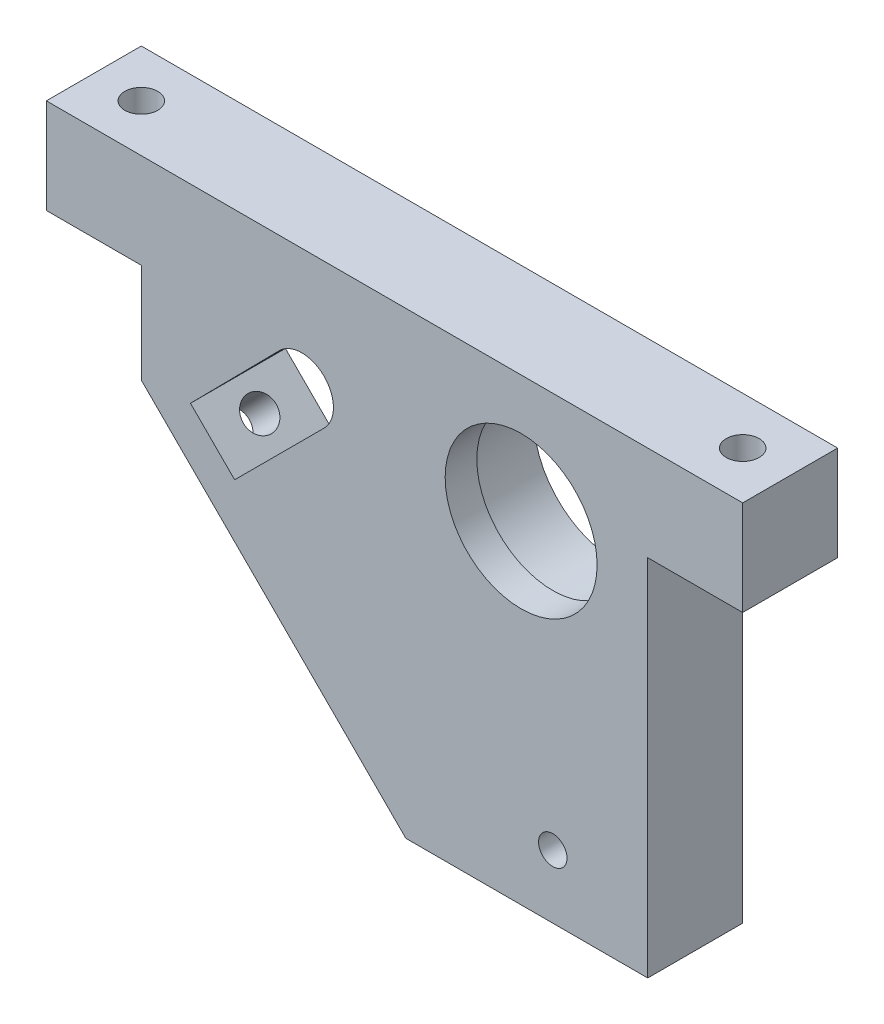
ISO-10303-21;
HEADER;
FILE_DESCRIPTION(('STEP AP214'),'2;1');
FILE_NAME('part.step','',(''),(''),'','','');
FILE_SCHEMA(('AUTOMOTIVE_DESIGN { 1 0 10303 214 1 1 1 1 }'));
ENDSEC;
DATA;
#1=APPLICATION_CONTEXT('core data for automotive mechanical design processes');
#2=APPLICATION_PROTOCOL_DEFINITION('international standard','automotive_design',2000,#1);
#3=PRODUCT_CONTEXT('',#1,'mechanical');
#4=PRODUCT('Part','Part','',(#3));
#5=PRODUCT_RELATED_PRODUCT_CATEGORY('part','',(#4));
#6=PRODUCT_DEFINITION_FORMATION('','',#4);
#7=PRODUCT_DEFINITION_CONTEXT('part definition',#1,'design');
#8=PRODUCT_DEFINITION('design','',#6,#7);
#9=PRODUCT_DEFINITION_SHAPE('','',#8);
#10=(LENGTH_UNIT() NAMED_UNIT(*) SI_UNIT(.MILLI.,.METRE.));
#11=(NAMED_UNIT(*) PLANE_ANGLE_UNIT() SI_UNIT($,.RADIAN.));
#12=(NAMED_UNIT(*) SI_UNIT($,.STERADIAN.) SOLID_ANGLE_UNIT());
#13=UNCERTAINTY_MEASURE_WITH_UNIT(LENGTH_MEASURE(1.E-05),#10,'distance_accuracy_value','');
#14=(GEOMETRIC_REPRESENTATION_CONTEXT(3) GLOBAL_UNCERTAINTY_ASSIGNED_CONTEXT((#13)) GLOBAL_UNIT_ASSIGNED_CONTEXT((#10,
#11,#12)) REPRESENTATION_CONTEXT('',''));
#15=CARTESIAN_POINT('',(0.,0.,0.));
#16=DIRECTION('',(0.,0.,1.));
#17=DIRECTION('',(1.,0.,0.));
#18=AXIS2_PLACEMENT_3D('',#15,#16,#17);
#19=CARTESIAN_POINT('',(41.1990103270224,21.4291974666358,15.));
#20=DIRECTION('',(0.,0.,-1.));
#21=DIRECTION('',(-1.,0.,0.));
#22=AXIS2_PLACEMENT_3D('',#19,#20,#21);
#23=CYLINDRICAL_SURFACE('',#22,12.);
#24=CARTESIAN_POINT('',(41.1990103270224,21.4291974666358,15.));
#25=DIRECTION('',(0.,0.,1.));
#26=DIRECTION('',(1.,0.,0.));
#27=AXIS2_PLACEMENT_3D('',#24,#25,#26);
#28=CIRCLE('',#27,12.);
#29=CARTESIAN_POINT('',(53.1990103270224,21.4291974666358,15.));
#30=VERTEX_POINT('',#29);
#31=EDGE_CURVE('E147',#30,#30,#28,.T.);
#32=ORIENTED_EDGE('',*,*,#31,.T.);
#33=EDGE_LOOP('',(#32));
#34=FACE_BOUND('',#33,.T.);
#35=CARTESIAN_POINT('',(41.1990103270224,21.4291974666358,10.));
#36=DIRECTION('',(0.,0.,-1.));
#37=DIRECTION('',(-1.,0.,0.));
#38=AXIS2_PLACEMENT_3D('',#35,#36,#37);
#39=CIRCLE('',#38,12.);
#40=CARTESIAN_POINT('',(29.1990103270224,21.4291974666358,10.));
#41=VERTEX_POINT('',#40);
#42=EDGE_CURVE('E234',#41,#41,#39,.T.);
#43=ORIENTED_EDGE('',*,*,#42,.T.);
#44=EDGE_LOOP('',(#43));
#45=FACE_BOUND('',#44,.T.);
#46=ADVANCED_FACE('F34',(#34,#45),#23,.F.);
#47=CARTESIAN_POINT('',(0.,0.,15.));
#48=DIRECTION('',(0.,0.,1.));
#49=DIRECTION('',(1.,0.,0.));
#50=AXIS2_PLACEMENT_3D('',#47,#48,#49);
#51=PLANE('',#50);
#52=DIRECTION('',(0.707106781186547,0.707106781186547,0.));
#53=VECTOR('',#52,1.);
#54=CARTESIAN_POINT('',(-4.05589655809395,4.45870760733599,15.));
#55=LINE('',#54,#53);
#56=CARTESIAN_POINT('',(-4.05589655809395,4.45870760733599,15.));
#57=VERTEX_POINT('',#56);
#58=CARTESIAN_POINT('',(10.0635366648149,18.5781408302448,15.));
#59=VERTEX_POINT('',#58);
#60=EDGE_CURVE('E139',#57,#59,#55,.T.);
#61=ORIENTED_EDGE('',*,*,#60,.F.);
#62=DIRECTION('',(0.707106781186546,-0.707106781186549,0.));
#63=VECTOR('',#62,1.);
#64=CARTESIAN_POINT('',(-11.0349733691785,11.4377844184205,15.));
#65=LINE('',#64,#63);
#66=CARTESIAN_POINT('',(-11.0349733691785,11.4377844184205,15.));
#67=VERTEX_POINT('',#66);
#68=EDGE_CURVE('E131',#67,#57,#65,.T.);
#69=ORIENTED_EDGE('',*,*,#68,.F.);
#70=DIRECTION('',(-0.702492273338831,-0.71169136983614,0.));
#71=VECTOR('',#70,1.);
#72=CARTESIAN_POINT('',(-11.0349733691785,11.4377844184205,15.));
#73=LINE('',#72,#71);
#74=CARTESIAN_POINT('',(2.99232119970095,25.6487656145165,15.));
#75=VERTEX_POINT('',#74);
#76=EDGE_CURVE('E155',#75,#67,#73,.T.);
#77=ORIENTED_EDGE('',*,*,#76,.F.);
#78=CARTESIAN_POINT('',(6.55077804888163,22.1363042478223,15.));
#79=DIRECTION('',(0.,0.,1.));
#80=DIRECTION('',(1.,0.,0.));
#81=AXIS2_PLACEMENT_3D('',#78,#79,#80);
#82=CIRCLE('',#81,5.00000000000001);
#83=EDGE_CURVE('E153',#59,#75,#82,.T.);
#84=ORIENTED_EDGE('',*,*,#83,.F.);
#85=EDGE_LOOP('',(#61,#69,#77,#84));
#86=FACE_BOUND('',#85,.T.);
#87=ORIENTED_EDGE('',*,*,#31,.F.);
#88=EDGE_LOOP('',(#87));
#89=FACE_BOUND('',#88,.T.);
#90=DIRECTION('',(0.,-1.,0.));
#91=VECTOR('',#90,1.);
#92=CARTESIAN_POINT('',(-33.8009896729777,41.4291974666358,15.));
#93=LINE('',#92,#91);
#94=CARTESIAN_POINT('',(-33.8009896729777,41.4291974666358,15.));
#95=VERTEX_POINT('',#94);
#96=CARTESIAN_POINT('',(-33.8009896729777,26.4291974666358,15.));
#97=VERTEX_POINT('',#96);
#98=EDGE_CURVE('E174',#95,#97,#93,.T.);
#99=ORIENTED_EDGE('',*,*,#98,.T.);
#100=DIRECTION('',(1.,0.,0.));
#101=VECTOR('',#100,1.);
#102=CARTESIAN_POINT('',(-33.8009896729777,26.4291974666358,15.));
#103=LINE('',#102,#101);
#104=CARTESIAN_POINT('',(-18.8009896729777,26.4291974666358,15.));
#105=VERTEX_POINT('',#104);
#106=EDGE_CURVE('E177',#97,#105,#103,.T.);
#107=ORIENTED_EDGE('',*,*,#106,.T.);
#108=DIRECTION('',(0.,-1.,0.));
#109=VECTOR('',#108,1.);
#110=CARTESIAN_POINT('',(-18.8009896729777,26.4291974666358,15.));
#111=LINE('',#110,#109);
#112=CARTESIAN_POINT('',(-18.8009896729777,10.7185193479812,15.));
#113=VERTEX_POINT('',#112);
#114=EDGE_CURVE('E180',#105,#113,#111,.T.);
#115=ORIENTED_EDGE('',*,*,#114,.T.);
#116=DIRECTION('',(0.707106781186546,-0.707106781186549,0.));
#117=VECTOR('',#116,1.);
#118=CARTESIAN_POINT('',(-18.8009896729777,10.7185193479812,15.));
#119=LINE('',#118,#117);
#120=CARTESIAN_POINT('',(22.9883322083676,-31.0708025333642,15.));
#121=VERTEX_POINT('',#120);
#122=EDGE_CURVE('E182',#113,#121,#119,.T.);
#123=ORIENTED_EDGE('',*,*,#122,.T.);
#124=DIRECTION('',(1.,0.,0.));
#125=VECTOR('',#124,1.);
#126=CARTESIAN_POINT('',(22.9883322083676,-31.0708025333642,15.));
#127=LINE('',#126,#125);
#128=CARTESIAN_POINT('',(61.1990103270224,-31.0708025333642,15.));
#129=VERTEX_POINT('',#128);
#130=EDGE_CURVE('E184',#121,#129,#127,.T.);
#131=ORIENTED_EDGE('',*,*,#130,.T.);
#132=DIRECTION('',(0.,1.,0.));
#133=VECTOR('',#132,1.);
#134=CARTESIAN_POINT('',(61.1990103270224,26.4291974666358,15.));
#135=LINE('',#134,#133);
#136=CARTESIAN_POINT('',(61.1990103270224,26.4291974666358,15.));
#137=VERTEX_POINT('',#136);
#138=EDGE_CURVE('E186',#129,#137,#135,.T.);
#139=ORIENTED_EDGE('',*,*,#138,.T.);
#140=DIRECTION('',(1.,0.,0.));
#141=VECTOR('',#140,1.);
#142=CARTESIAN_POINT('',(76.1990103270224,26.4291974666358,15.));
#143=LINE('',#142,#141);
#144=CARTESIAN_POINT('',(76.1990103270224,26.4291974666358,15.));
#145=VERTEX_POINT('',#144);
#146=EDGE_CURVE('E188',#137,#145,#143,.T.);
#147=ORIENTED_EDGE('',*,*,#146,.T.);
#148=DIRECTION('',(0.,1.,0.));
#149=VECTOR('',#148,1.);
#150=CARTESIAN_POINT('',(76.1990103270224,41.4291974666358,15.));
#151=LINE('',#150,#149);
#152=CARTESIAN_POINT('',(76.1990103270224,41.4291974666358,15.));
#153=VERTEX_POINT('',#152);
#154=EDGE_CURVE('E190',#145,#153,#151,.T.);
#155=ORIENTED_EDGE('',*,*,#154,.T.);
#156=DIRECTION('',(-1.,0.,0.));
#157=VECTOR('',#156,1.);
#158=CARTESIAN_POINT('',(56.1990103270223,41.4291974666358,15.));
#159=LINE('',#158,#157);
#160=EDGE_CURVE('E192',#153,#95,#159,.T.);
#161=ORIENTED_EDGE('',*,*,#160,.T.);
#162=EDGE_LOOP('',(#99,#107,#115,#123,#131,#139,#147,#155,#161));
#163=FACE_BOUND('',#162,.T.);
#164=CARTESIAN_POINT('',(46.1990103270224,-21.0708025333642,15.));
#165=DIRECTION('',(0.,0.,1.));
#166=DIRECTION('',(1.,0.,0.));
#167=AXIS2_PLACEMENT_3D('',#164,#165,#166);
#168=CIRCLE('',#167,2.25);
#169=CARTESIAN_POINT('',(48.4490103270224,-21.0708025333642,15.));
#170=VERTEX_POINT('',#169);
#171=EDGE_CURVE('E161',#170,#170,#168,.T.);
#172=ORIENTED_EDGE('',*,*,#171,.F.);
#173=EDGE_LOOP('',(#172));
#174=FACE_BOUND('',#173,.T.);
#175=ADVANCED_FACE('F151',(#86,#89,#163,#174),#51,.T.);
#176=CARTESIAN_POINT('',(0.,0.,0.));
#177=DIRECTION('',(0.,0.,1.));
#178=DIRECTION('',(1.,0.,0.));
#179=AXIS2_PLACEMENT_3D('',#176,#177,#178);
#180=PLANE('',#179);
#181=CARTESIAN_POINT('',(41.1990103270224,21.4291974666358,0.));
#182=DIRECTION('',(0.,0.,-1.));
#183=DIRECTION('',(-1.,0.,0.));
#184=AXIS2_PLACEMENT_3D('',#181,#182,#183);
#185=CIRCLE('',#184,13.);
#186=CARTESIAN_POINT('',(28.1990103270224,21.4291974666358,0.));
#187=VERTEX_POINT('',#186);
#188=EDGE_CURVE('E242',#187,#187,#185,.T.);
#189=ORIENTED_EDGE('',*,*,#188,.F.);
#190=EDGE_LOOP('',(#189));
#191=FACE_BOUND('',#190,.T.);
#192=DIRECTION('',(0.,-1.,0.));
#193=VECTOR('',#192,1.);
#194=CARTESIAN_POINT('',(-33.8009896729777,41.4291974666358,0.));
#195=LINE('',#194,#193);
#196=CARTESIAN_POINT('',(-33.8009896729777,41.4291974666358,0.));
#197=VERTEX_POINT('',#196);
#198=CARTESIAN_POINT('',(-33.8009896729777,26.4291974666358,0.));
#199=VERTEX_POINT('',#198);
#200=EDGE_CURVE('E173',#197,#199,#195,.T.);
#201=ORIENTED_EDGE('',*,*,#200,.F.);
#202=DIRECTION('',(-1.,0.,0.));
#203=VECTOR('',#202,1.);
#204=CARTESIAN_POINT('',(-33.8009896729777,41.4291974666358,0.));
#205=LINE('',#204,#203);
#206=CARTESIAN_POINT('',(76.1990103270224,41.4291974666358,0.));
#207=VERTEX_POINT('',#206);
#208=EDGE_CURVE('E178',#207,#197,#205,.T.);
#209=ORIENTED_EDGE('',*,*,#208,.F.);
#210=DIRECTION('',(0.,1.,0.));
#211=VECTOR('',#210,1.);
#212=CARTESIAN_POINT('',(76.1990103270224,41.4291974666358,0.));
#213=LINE('',#212,#211);
#214=CARTESIAN_POINT('',(76.1990103270224,26.4291974666358,0.));
#215=VERTEX_POINT('',#214);
#216=EDGE_CURVE('E209',#215,#207,#213,.T.);
#217=ORIENTED_EDGE('',*,*,#216,.F.);
#218=DIRECTION('',(1.,0.,0.));
#219=VECTOR('',#218,1.);
#220=CARTESIAN_POINT('',(76.1990103270224,26.4291974666358,0.));
#221=LINE('',#220,#219);
#222=CARTESIAN_POINT('',(61.1990103270224,26.4291974666358,0.));
#223=VERTEX_POINT('',#222);
#224=EDGE_CURVE('E207',#223,#215,#221,.T.);
#225=ORIENTED_EDGE('',*,*,#224,.F.);
#226=DIRECTION('',(0.,1.,0.));
#227=VECTOR('',#226,1.);
#228=CARTESIAN_POINT('',(61.1990103270224,26.4291974666358,0.));
#229=LINE('',#228,#227);
#230=CARTESIAN_POINT('',(61.1990103270224,-31.0708025333642,0.));
#231=VERTEX_POINT('',#230);
#232=EDGE_CURVE('E205',#231,#223,#229,.T.);
#233=ORIENTED_EDGE('',*,*,#232,.F.);
#234=DIRECTION('',(1.,0.,0.));
#235=VECTOR('',#234,1.);
#236=CARTESIAN_POINT('',(22.9883322083676,-31.0708025333642,0.));
#237=LINE('',#236,#235);
#238=CARTESIAN_POINT('',(22.9883322083676,-31.0708025333642,0.));
#239=VERTEX_POINT('',#238);
#240=EDGE_CURVE('E203',#239,#231,#237,.T.);
#241=ORIENTED_EDGE('',*,*,#240,.F.);
#242=DIRECTION('',(0.707106781186546,-0.707106781186549,0.));
#243=VECTOR('',#242,1.);
#244=CARTESIAN_POINT('',(-18.8009896729777,10.7185193479812,0.));
#245=LINE('',#244,#243);
#246=CARTESIAN_POINT('',(-18.8009896729777,10.7185193479812,0.));
#247=VERTEX_POINT('',#246);
#248=EDGE_CURVE('E201',#247,#239,#245,.T.);
#249=ORIENTED_EDGE('',*,*,#248,.F.);
#250=DIRECTION('',(0.,-1.,0.));
#251=VECTOR('',#250,1.);
#252=CARTESIAN_POINT('',(-18.8009896729777,26.4291974666358,0.));
#253=LINE('',#252,#251);
#254=CARTESIAN_POINT('',(-18.8009896729777,26.4291974666358,0.));
#255=VERTEX_POINT('',#254);
#256=EDGE_CURVE('E199',#255,#247,#253,.T.);
#257=ORIENTED_EDGE('',*,*,#256,.F.);
#258=DIRECTION('',(1.,0.,0.));
#259=VECTOR('',#258,1.);
#260=CARTESIAN_POINT('',(-27.4405999797669,26.4291974666358,0.));
#261=LINE('',#260,#259);
#262=EDGE_CURVE('E197',#199,#255,#261,.T.);
#263=ORIENTED_EDGE('',*,*,#262,.F.);
#264=EDGE_LOOP('',(#201,#209,#217,#225,#233,#241,#249,#257,#263));
#265=FACE_BOUND('',#264,.T.);
#266=DIRECTION('',(0.707106781186546,-0.707106781186549,0.));
#267=VECTOR('',#266,1.);
#268=CARTESIAN_POINT('',(-11.0349733691785,11.4377844184205,0.));
#269=LINE('',#268,#267);
#270=CARTESIAN_POINT('',(-11.0349733691785,11.4377844184205,0.));
#271=VERTEX_POINT('',#270);
#272=CARTESIAN_POINT('',(-4.05589655809395,4.45870760733599,0.));
#273=VERTEX_POINT('',#272);
#274=EDGE_CURVE('E59',#271,#273,#269,.T.);
#275=ORIENTED_EDGE('',*,*,#274,.T.);
#276=DIRECTION('',(0.707106781186547,0.707106781186547,0.));
#277=VECTOR('',#276,1.);
#278=CARTESIAN_POINT('',(-4.05589655809395,4.45870760733599,0.));
#279=LINE('',#278,#277);
#280=CARTESIAN_POINT('',(10.0635366648149,18.5781408302448,0.));
#281=VERTEX_POINT('',#280);
#282=EDGE_CURVE('E146',#273,#281,#279,.T.);
#283=ORIENTED_EDGE('',*,*,#282,.T.);
#284=CARTESIAN_POINT('',(6.55077804888163,22.1363042478223,0.));
#285=DIRECTION('',(0.,0.,1.));
#286=DIRECTION('',(1.,0.,0.));
#287=AXIS2_PLACEMENT_3D('',#284,#285,#286);
#288=CIRCLE('',#287,5.00000000000001);
#289=CARTESIAN_POINT('',(2.99232119970094,25.6487656145165,0.));
#290=VERTEX_POINT('',#289);
#291=EDGE_CURVE('E163',#281,#290,#288,.T.);
#292=ORIENTED_EDGE('',*,*,#291,.T.);
#293=DIRECTION('',(-0.702492273338831,-0.71169136983614,0.));
#294=VECTOR('',#293,1.);
#295=CARTESIAN_POINT('',(-11.0349733691785,11.4377844184205,0.));
#296=LINE('',#295,#294);
#297=EDGE_CURVE('E140',#290,#271,#296,.T.);
#298=ORIENTED_EDGE('',*,*,#297,.T.);
#299=EDGE_LOOP('',(#275,#283,#292,#298));
#300=FACE_BOUND('',#299,.T.);
#301=CARTESIAN_POINT('',(46.1990103270224,-21.0708025333642,0.));
#302=DIRECTION('',(0.,0.,1.));
#303=DIRECTION('',(1.,0.,0.));
#304=AXIS2_PLACEMENT_3D('',#301,#302,#303);
#305=CIRCLE('',#304,2.25);
#306=CARTESIAN_POINT('',(48.4490103270224,-21.0708025333642,0.));
#307=VERTEX_POINT('',#306);
#308=EDGE_CURVE('E236',#307,#307,#305,.T.);
#309=ORIENTED_EDGE('',*,*,#308,.T.);
#310=EDGE_LOOP('',(#309));
#311=FACE_BOUND('',#310,.T.);
#312=ADVANCED_FACE('F259',(#191,#265,#300,#311),#180,.F.);
#313=CARTESIAN_POINT('',(-33.8009896729777,41.4291974666358,15.));
#314=DIRECTION('',(1.,0.,0.));
#315=DIRECTION('',(0.,1.,0.));
#316=AXIS2_PLACEMENT_3D('',#313,#314,#315);
#317=PLANE('',#316);
#318=ORIENTED_EDGE('',*,*,#200,.T.);
#319=DIRECTION('',(0.,0.,-1.));
#320=VECTOR('',#319,1.);
#321=CARTESIAN_POINT('',(-33.8009896729777,26.4291974666358,15.));
#322=LINE('',#321,#320);
#323=EDGE_CURVE('E11',#97,#199,#322,.T.);
#324=ORIENTED_EDGE('',*,*,#323,.F.);
#325=ORIENTED_EDGE('',*,*,#98,.F.);
#326=DIRECTION('',(0.,0.,-1.));
#327=VECTOR('',#326,1.);
#328=CARTESIAN_POINT('',(-33.8009896729777,41.4291974666358,15.));
#329=LINE('',#328,#327);
#330=EDGE_CURVE('E194',#95,#197,#329,.T.);
#331=ORIENTED_EDGE('',*,*,#330,.T.);
#332=EDGE_LOOP('',(#318,#324,#325,#331));
#333=FACE_BOUND('',#332,.T.);
#334=ADVANCED_FACE('F36',(#333),#317,.F.);
#335=CARTESIAN_POINT('',(-27.4405999797669,26.4291974666358,15.));
#336=DIRECTION('',(0.,1.,0.));
#337=DIRECTION('',(0.,0.,1.));
#338=AXIS2_PLACEMENT_3D('',#335,#336,#337);
#339=PLANE('',#338);
#340=CARTESIAN_POINT('',(-26.3009896729777,26.4291974666358,7.5));
#341=DIRECTION('',(0.,1.,0.));
#342=DIRECTION('',(0.,0.,1.));
#343=AXIS2_PLACEMENT_3D('',#340,#341,#342);
#344=CIRCLE('',#343,2.6);
#345=CARTESIAN_POINT('',(-26.3009896729777,26.4291974666358,10.1));
#346=VERTEX_POINT('',#345);
#347=EDGE_CURVE('E247',#346,#346,#344,.T.);
#348=ORIENTED_EDGE('',*,*,#347,.T.);
#349=EDGE_LOOP('',(#348));
#350=FACE_BOUND('',#349,.T.);
#351=ORIENTED_EDGE('',*,*,#262,.T.);
#352=DIRECTION('',(0.,0.,-1.));
#353=VECTOR('',#352,1.);
#354=CARTESIAN_POINT('',(-18.8009896729777,26.4291974666358,15.));
#355=LINE('',#354,#353);
#356=EDGE_CURVE('E43',#105,#255,#355,.T.);
#357=ORIENTED_EDGE('',*,*,#356,.F.);
#358=ORIENTED_EDGE('',*,*,#106,.F.);
#359=ORIENTED_EDGE('',*,*,#323,.T.);
#360=EDGE_LOOP('',(#351,#357,#358,#359));
#361=FACE_BOUND('',#360,.T.);
#362=ADVANCED_FACE('F297',(#350,#361),#339,.F.);
#363=CARTESIAN_POINT('',(-18.8009896729777,26.4291974666358,15.));
#364=DIRECTION('',(1.,0.,0.));
#365=DIRECTION('',(0.,1.,0.));
#366=AXIS2_PLACEMENT_3D('',#363,#364,#365);
#367=PLANE('',#366);
#368=ORIENTED_EDGE('',*,*,#256,.T.);
#369=DIRECTION('',(0.,0.,-1.));
#370=VECTOR('',#369,1.);
#371=CARTESIAN_POINT('',(-18.8009896729777,10.7185193479812,15.));
#372=LINE('',#371,#370);
#373=EDGE_CURVE('E230',#113,#247,#372,.T.);
#374=ORIENTED_EDGE('',*,*,#373,.F.);
#375=ORIENTED_EDGE('',*,*,#114,.F.);
#376=ORIENTED_EDGE('',*,*,#356,.T.);
#377=EDGE_LOOP('',(#368,#374,#375,#376));
#378=FACE_BOUND('',#377,.T.);
#379=ADVANCED_FACE('F294',(#378),#367,.F.);
#380=CARTESIAN_POINT('',(-18.8009896729777,10.7185193479812,15.));
#381=DIRECTION('',(0.707106781186549,0.707106781186546,0.));
#382=DIRECTION('',(-0.707106781186546,0.707106781186549,0.));
#383=AXIS2_PLACEMENT_3D('',#380,#381,#382);
#384=PLANE('',#383);
#385=CARTESIAN_POINT('',(-11.8359878782902,3.75351755329367,7.5));
#386=DIRECTION('',(-0.707106781186548,-0.707106781186547,0.));
#387=DIRECTION('',(0.707106781186547,-0.707106781186548,0.));
#388=AXIS2_PLACEMENT_3D('',#385,#386,#387);
#389=CIRCLE('',#388,2.6);
#390=CARTESIAN_POINT('',(-9.99751024720517,1.91503992220864,7.5));
#391=VERTEX_POINT('',#390);
#392=EDGE_CURVE('E367',#391,#391,#389,.T.);
#393=ORIENTED_EDGE('',*,*,#392,.F.);
#394=EDGE_LOOP('',(#393));
#395=FACE_BOUND('',#394,.T.);
#396=ORIENTED_EDGE('',*,*,#248,.T.);
#397=DIRECTION('',(0.,0.,-1.));
#398=VECTOR('',#397,1.);
#399=CARTESIAN_POINT('',(22.9883322083676,-31.0708025333642,15.));
#400=LINE('',#399,#398);
#401=EDGE_CURVE('E227',#121,#239,#400,.T.);
#402=ORIENTED_EDGE('',*,*,#401,.F.);
#403=ORIENTED_EDGE('',*,*,#122,.F.);
#404=ORIENTED_EDGE('',*,*,#373,.T.);
#405=EDGE_LOOP('',(#396,#402,#403,#404));
#406=FACE_BOUND('',#405,.T.);
#407=ADVANCED_FACE('F290',(#395,#406),#384,.F.);
#408=CARTESIAN_POINT('',(22.9883322083676,-31.0708025333642,15.));
#409=DIRECTION('',(0.,1.,0.));
#410=DIRECTION('',(0.,0.,1.));
#411=AXIS2_PLACEMENT_3D('',#408,#409,#410);
#412=PLANE('',#411);
#413=ORIENTED_EDGE('',*,*,#240,.T.);
#414=DIRECTION('',(0.,0.,-1.));
#415=VECTOR('',#414,1.);
#416=CARTESIAN_POINT('',(61.1990103270224,-31.0708025333642,15.));
#417=LINE('',#416,#415);
#418=EDGE_CURVE('E224',#129,#231,#417,.T.);
#419=ORIENTED_EDGE('',*,*,#418,.F.);
#420=ORIENTED_EDGE('',*,*,#130,.F.);
#421=ORIENTED_EDGE('',*,*,#401,.T.);
#422=EDGE_LOOP('',(#413,#419,#420,#421));
#423=FACE_BOUND('',#422,.T.);
#424=ADVANCED_FACE('F286',(#423),#412,.F.);
#425=CARTESIAN_POINT('',(61.1990103270224,26.4291974666358,15.));
#426=DIRECTION('',(-1.,0.,0.));
#427=DIRECTION('',(0.,-1.,0.));
#428=AXIS2_PLACEMENT_3D('',#425,#426,#427);
#429=PLANE('',#428);
#430=ORIENTED_EDGE('',*,*,#232,.T.);
#431=DIRECTION('',(0.,0.,-1.));
#432=VECTOR('',#431,1.);
#433=CARTESIAN_POINT('',(61.1990103270224,26.4291974666358,15.));
#434=LINE('',#433,#432);
#435=EDGE_CURVE('E221',#137,#223,#434,.T.);
#436=ORIENTED_EDGE('',*,*,#435,.F.);
#437=ORIENTED_EDGE('',*,*,#138,.F.);
#438=ORIENTED_EDGE('',*,*,#418,.T.);
#439=EDGE_LOOP('',(#430,#436,#437,#438));
#440=FACE_BOUND('',#439,.T.);
#441=ADVANCED_FACE('F282',(#440),#429,.F.);
#442=CARTESIAN_POINT('',(76.1990103270224,26.4291974666358,15.));
#443=DIRECTION('',(0.,1.,0.));
#444=DIRECTION('',(0.,0.,1.));
#445=AXIS2_PLACEMENT_3D('',#442,#443,#444);
#446=PLANE('',#445);
#447=CARTESIAN_POINT('',(68.6990103270224,26.4291974666358,7.5));
#448=DIRECTION('',(0.,1.,0.));
#449=DIRECTION('',(0.,0.,1.));
#450=AXIS2_PLACEMENT_3D('',#447,#448,#449);
#451=CIRCLE('',#450,2.6);
#452=CARTESIAN_POINT('',(68.6990103270224,26.4291974666358,10.1));
#453=VERTEX_POINT('',#452);
#454=EDGE_CURVE('E377',#453,#453,#451,.T.);
#455=ORIENTED_EDGE('',*,*,#454,.T.);
#456=EDGE_LOOP('',(#455));
#457=FACE_BOUND('',#456,.T.);
#458=ORIENTED_EDGE('',*,*,#224,.T.);
#459=DIRECTION('',(0.,0.,-1.));
#460=VECTOR('',#459,1.);
#461=CARTESIAN_POINT('',(76.1990103270224,26.4291974666358,15.));
#462=LINE('',#461,#460);
#463=EDGE_CURVE('E218',#145,#215,#462,.T.);
#464=ORIENTED_EDGE('',*,*,#463,.F.);
#465=ORIENTED_EDGE('',*,*,#146,.F.);
#466=ORIENTED_EDGE('',*,*,#435,.T.);
#467=EDGE_LOOP('',(#458,#464,#465,#466));
#468=FACE_BOUND('',#467,.T.);
#469=ADVANCED_FACE('F278',(#457,#468),#446,.F.);
#470=CARTESIAN_POINT('',(76.1990103270224,41.4291974666358,15.));
#471=DIRECTION('',(-1.,0.,0.));
#472=DIRECTION('',(0.,0.,1.));
#473=AXIS2_PLACEMENT_3D('',#470,#471,#472);
#474=PLANE('',#473);
#475=ORIENTED_EDGE('',*,*,#216,.T.);
#476=DIRECTION('',(0.,0.,-1.));
#477=VECTOR('',#476,1.);
#478=CARTESIAN_POINT('',(76.1990103270224,41.4291974666358,15.));
#479=LINE('',#478,#477);
#480=EDGE_CURVE('E215',#153,#207,#479,.T.);
#481=ORIENTED_EDGE('',*,*,#480,.F.);
#482=ORIENTED_EDGE('',*,*,#154,.F.);
#483=ORIENTED_EDGE('',*,*,#463,.T.);
#484=EDGE_LOOP('',(#475,#481,#482,#483));
#485=FACE_BOUND('',#484,.T.);
#486=ADVANCED_FACE('F274',(#485),#474,.F.);
#487=CARTESIAN_POINT('',(-33.8009896729777,41.4291974666358,15.));
#488=DIRECTION('',(0.,-1.,0.));
#489=DIRECTION('',(0.,0.,-1.));
#490=AXIS2_PLACEMENT_3D('',#487,#488,#489);
#491=PLANE('',#490);
#492=CARTESIAN_POINT('',(-26.3009896729777,41.4291974666358,7.5));
#493=DIRECTION('',(0.,1.,0.));
#494=DIRECTION('',(0.,0.,1.));
#495=AXIS2_PLACEMENT_3D('',#492,#493,#494);
#496=CIRCLE('',#495,2.6);
#497=CARTESIAN_POINT('',(-26.3009896729777,41.4291974666358,10.1));
#498=VERTEX_POINT('',#497);
#499=EDGE_CURVE('E369',#498,#498,#496,.T.);
#500=ORIENTED_EDGE('',*,*,#499,.F.);
#501=EDGE_LOOP('',(#500));
#502=FACE_BOUND('',#501,.T.);
#503=CARTESIAN_POINT('',(68.6990103270224,41.4291974666358,7.5));
#504=DIRECTION('',(0.,1.,0.));
#505=DIRECTION('',(0.,0.,1.));
#506=AXIS2_PLACEMENT_3D('',#503,#504,#505);
#507=CIRCLE('',#506,2.6);
#508=CARTESIAN_POINT('',(68.6990103270224,41.4291974666358,10.1));
#509=VERTEX_POINT('',#508);
#510=EDGE_CURVE('E366',#509,#509,#507,.T.);
#511=ORIENTED_EDGE('',*,*,#510,.F.);
#512=EDGE_LOOP('',(#511));
#513=FACE_BOUND('',#512,.T.);
#514=ORIENTED_EDGE('',*,*,#208,.T.);
#515=ORIENTED_EDGE('',*,*,#330,.F.);
#516=ORIENTED_EDGE('',*,*,#160,.F.);
#517=ORIENTED_EDGE('',*,*,#480,.T.);
#518=EDGE_LOOP('',(#514,#515,#516,#517));
#519=FACE_BOUND('',#518,.T.);
#520=ADVANCED_FACE('F271',(#502,#513,#519),#491,.F.);
#521=CARTESIAN_POINT('',(-11.0349733691785,11.4377844184205,15.));
#522=DIRECTION('',(0.707106781186549,0.707106781186546,0.));
#523=DIRECTION('',(-0.707106781186546,0.707106781186549,0.));
#524=AXIS2_PLACEMENT_3D('',#521,#522,#523);
#525=PLANE('',#524);
#526=CARTESIAN_POINT('',(-7.5933471911709,7.99615824041295,7.5));
#527=DIRECTION('',(0.707106781186549,0.707106781186546,0.));
#528=DIRECTION('',(-0.707106781186546,0.707106781186549,0.));
#529=AXIS2_PLACEMENT_3D('',#526,#527,#528);
#530=CIRCLE('',#529,2.6);
#531=CARTESIAN_POINT('',(-9.43182482225592,9.83463587149798,7.5));
#532=VERTEX_POINT('',#531);
#533=EDGE_CURVE('E38',#532,#532,#530,.T.);
#534=ORIENTED_EDGE('',*,*,#533,.F.);
#535=EDGE_LOOP('',(#534));
#536=FACE_BOUND('',#535,.T.);
#537=ORIENTED_EDGE('',*,*,#274,.F.);
#538=DIRECTION('',(0.,0.,-1.));
#539=VECTOR('',#538,1.);
#540=CARTESIAN_POINT('',(-11.0349733691785,11.4377844184205,15.));
#541=LINE('',#540,#539);
#542=EDGE_CURVE('E135',#67,#271,#541,.T.);
#543=ORIENTED_EDGE('',*,*,#542,.F.);
#544=ORIENTED_EDGE('',*,*,#68,.T.);
#545=DIRECTION('',(0.,0.,-1.));
#546=VECTOR('',#545,1.);
#547=CARTESIAN_POINT('',(-4.05589655809395,4.45870760733599,15.));
#548=LINE('',#547,#546);
#549=EDGE_CURVE('E134',#57,#273,#548,.T.);
#550=ORIENTED_EDGE('',*,*,#549,.T.);
#551=EDGE_LOOP('',(#537,#543,#544,#550));
#552=FACE_BOUND('',#551,.T.);
#553=ADVANCED_FACE('F133',(#536,#552),#525,.T.);
#554=CARTESIAN_POINT('',(-4.05589655809395,4.45870760733599,15.));
#555=DIRECTION('',(-0.707106781186547,0.707106781186547,0.));
#556=DIRECTION('',(-0.707106781186548,-0.707106781186548,0.));
#557=AXIS2_PLACEMENT_3D('',#554,#555,#556);
#558=PLANE('',#557);
#559=ORIENTED_EDGE('',*,*,#282,.F.);
#560=ORIENTED_EDGE('',*,*,#549,.F.);
#561=ORIENTED_EDGE('',*,*,#60,.T.);
#562=DIRECTION('',(0.,0.,-1.));
#563=VECTOR('',#562,1.);
#564=CARTESIAN_POINT('',(10.0635366648149,18.5781408302448,15.));
#565=LINE('',#564,#563);
#566=EDGE_CURVE('E148',#59,#281,#565,.T.);
#567=ORIENTED_EDGE('',*,*,#566,.T.);
#568=EDGE_LOOP('',(#559,#560,#561,#567));
#569=FACE_BOUND('',#568,.T.);
#570=ADVANCED_FACE('F143',(#569),#558,.T.);
#571=CARTESIAN_POINT('',(6.55077804888163,22.1363042478223,15.));
#572=DIRECTION('',(0.,0.,-1.));
#573=DIRECTION('',(-1.,0.,0.));
#574=AXIS2_PLACEMENT_3D('',#571,#572,#573);
#575=CYLINDRICAL_SURFACE('',#574,5.00000000000001);
#576=ORIENTED_EDGE('',*,*,#291,.F.);
#577=ORIENTED_EDGE('',*,*,#566,.F.);
#578=ORIENTED_EDGE('',*,*,#83,.T.);
#579=DIRECTION('',(0.,0.,-1.));
#580=VECTOR('',#579,1.);
#581=CARTESIAN_POINT('',(2.99232119970094,25.6487656145165,15.));
#582=LINE('',#581,#580);
#583=EDGE_CURVE('E51',#75,#290,#582,.T.);
#584=ORIENTED_EDGE('',*,*,#583,.T.);
#585=EDGE_LOOP('',(#576,#577,#578,#584));
#586=FACE_BOUND('',#585,.T.);
#587=ADVANCED_FACE('F351',(#586),#575,.F.);
#588=CARTESIAN_POINT('',(-11.0349733691785,11.4377844184205,15.));
#589=DIRECTION('',(0.71169136983614,-0.702492273338831,0.));
#590=DIRECTION('',(0.702492273338831,0.71169136983614,0.));
#591=AXIS2_PLACEMENT_3D('',#588,#589,#590);
#592=PLANE('',#591);
#593=ORIENTED_EDGE('',*,*,#297,.F.);
#594=ORIENTED_EDGE('',*,*,#583,.F.);
#595=ORIENTED_EDGE('',*,*,#76,.T.);
#596=ORIENTED_EDGE('',*,*,#542,.T.);
#597=EDGE_LOOP('',(#593,#594,#595,#596));
#598=FACE_BOUND('',#597,.T.);
#599=ADVANCED_FACE('F342',(#598),#592,.T.);
#600=CARTESIAN_POINT('',(46.1990103270224,-21.0708025333642,15.));
#601=DIRECTION('',(0.,0.,-1.));
#602=DIRECTION('',(-1.,0.,0.));
#603=AXIS2_PLACEMENT_3D('',#600,#601,#602);
#604=CYLINDRICAL_SURFACE('',#603,2.25);
#605=ORIENTED_EDGE('',*,*,#171,.T.);
#606=EDGE_LOOP('',(#605));
#607=FACE_BOUND('',#606,.T.);
#608=ORIENTED_EDGE('',*,*,#308,.F.);
#609=EDGE_LOOP('',(#608));
#610=FACE_BOUND('',#609,.T.);
#611=ADVANCED_FACE('F255',(#607,#610),#604,.F.);
#612=CARTESIAN_POINT('',(41.1990103270224,21.4291974666358,10.));
#613=DIRECTION('',(0.,0.,-1.));
#614=DIRECTION('',(-1.,0.,0.));
#615=AXIS2_PLACEMENT_3D('',#612,#613,#614);
#616=CYLINDRICAL_SURFACE('',#615,13.);
#617=CARTESIAN_POINT('',(41.1990103270224,21.4291974666358,10.));
#618=DIRECTION('',(0.,0.,-1.));
#619=DIRECTION('',(-1.,0.,0.));
#620=AXIS2_PLACEMENT_3D('',#617,#618,#619);
#621=CIRCLE('',#620,13.);
#622=CARTESIAN_POINT('',(28.1990103270224,21.4291974666358,10.));
#623=VERTEX_POINT('',#622);
#624=EDGE_CURVE('E237',#623,#623,#621,.T.);
#625=ORIENTED_EDGE('',*,*,#624,.F.);
#626=EDGE_LOOP('',(#625));
#627=FACE_BOUND('',#626,.T.);
#628=ORIENTED_EDGE('',*,*,#188,.T.);
#629=EDGE_LOOP('',(#628));
#630=FACE_BOUND('',#629,.T.);
#631=ADVANCED_FACE('F341',(#627,#630),#616,.F.);
#632=CARTESIAN_POINT('',(41.1990103270224,21.4291974666358,10.));
#633=DIRECTION('',(0.,0.,-1.));
#634=DIRECTION('',(-1.,0.,0.));
#635=AXIS2_PLACEMENT_3D('',#632,#633,#634);
#636=PLANE('',#635);
#637=ORIENTED_EDGE('',*,*,#42,.F.);
#638=EDGE_LOOP('',(#637));
#639=FACE_BOUND('',#638,.T.);
#640=ORIENTED_EDGE('',*,*,#624,.T.);
#641=EDGE_LOOP('',(#640));
#642=FACE_BOUND('',#641,.T.);
#643=ADVANCED_FACE('F348',(#639,#642),#636,.T.);
#644=CARTESIAN_POINT('',(68.6990103270224,-31.0708025333642,7.5));
#645=DIRECTION('',(0.,1.,0.));
#646=DIRECTION('',(0.,0.,1.));
#647=AXIS2_PLACEMENT_3D('',#644,#645,#646);
#648=CYLINDRICAL_SURFACE('',#647,2.6);
#649=ORIENTED_EDGE('',*,*,#510,.T.);
#650=EDGE_LOOP('',(#649));
#651=FACE_BOUND('',#650,.T.);
#652=ORIENTED_EDGE('',*,*,#454,.F.);
#653=EDGE_LOOP('',(#652));
#654=FACE_BOUND('',#653,.T.);
#655=ADVANCED_FACE('F381',(#651,#654),#648,.F.);
#656=CARTESIAN_POINT('',(-26.3009896729777,-31.0708025333642,7.5));
#657=DIRECTION('',(0.,1.,0.));
#658=DIRECTION('',(0.,0.,1.));
#659=AXIS2_PLACEMENT_3D('',#656,#657,#658);
#660=CYLINDRICAL_SURFACE('',#659,2.6);
#661=ORIENTED_EDGE('',*,*,#499,.T.);
#662=EDGE_LOOP('',(#661));
#663=FACE_BOUND('',#662,.T.);
#664=ORIENTED_EDGE('',*,*,#347,.F.);
#665=EDGE_LOOP('',(#664));
#666=FACE_BOUND('',#665,.T.);
#667=ADVANCED_FACE('F383',(#663,#666),#660,.F.);
#668=CARTESIAN_POINT('',(-4.76492006642471,10.8245853651591,7.5));
#669=DIRECTION('',(-0.707106781186548,-0.707106781186547,0.));
#670=DIRECTION('',(0.707106781186547,-0.707106781186548,0.));
#671=AXIS2_PLACEMENT_3D('',#668,#669,#670);
#672=CYLINDRICAL_SURFACE('',#671,2.6);
#673=ORIENTED_EDGE('',*,*,#533,.T.);
#674=EDGE_LOOP('',(#673));
#675=FACE_BOUND('',#674,.T.);
#676=ORIENTED_EDGE('',*,*,#392,.T.);
#677=EDGE_LOOP('',(#676));
#678=FACE_BOUND('',#677,.T.);
#679=ADVANCED_FACE('F390',(#675,#678),#672,.F.);
#680=CLOSED_SHELL('',(#46,#175,#312,#334,#362,#379,#407,#424,#441,#469,#486,#520,#553,#570,#587,
#599,#611,#631,#643,#655,#667,#679));
#681=MANIFOLD_SOLID_BREP('B2',#680);
#682=ADVANCED_BREP_SHAPE_REPRESENTATION('',(#18,#681),#14);
#683=SHAPE_DEFINITION_REPRESENTATION(#9,#682);
ENDSEC;
END-ISO-10303-21;
